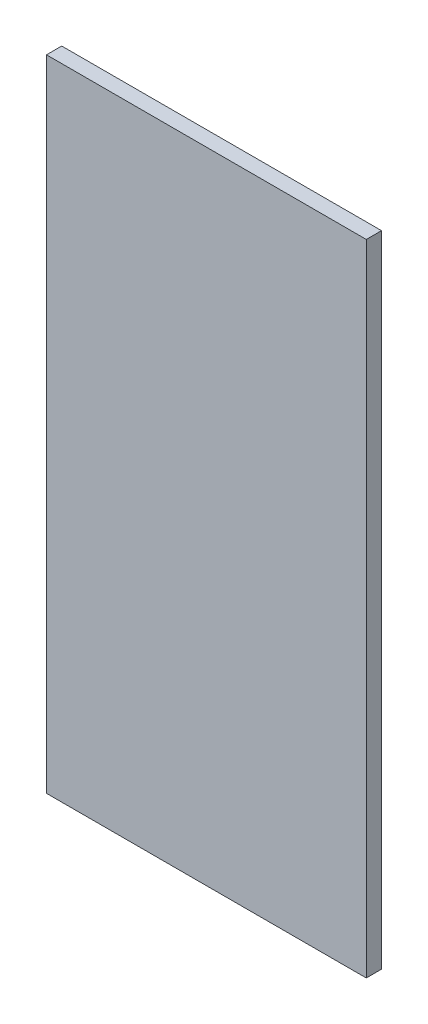
ISO-10303-21;
HEADER;
FILE_DESCRIPTION(('STEP AP214'),'2;1');
FILE_NAME('part.step','',(''),(''),'','','');
FILE_SCHEMA(('AUTOMOTIVE_DESIGN { 1 0 10303 214 1 1 1 1 }'));
ENDSEC;
DATA;
#1=APPLICATION_CONTEXT('core data for automotive mechanical design processes');
#2=APPLICATION_PROTOCOL_DEFINITION('international standard','automotive_design',2000,#1);
#3=PRODUCT_CONTEXT('',#1,'mechanical');
#4=PRODUCT('Part','Part','',(#3));
#5=PRODUCT_RELATED_PRODUCT_CATEGORY('part','',(#4));
#6=PRODUCT_DEFINITION_FORMATION('','',#4);
#7=PRODUCT_DEFINITION_CONTEXT('part definition',#1,'design');
#8=PRODUCT_DEFINITION('design','',#6,#7);
#9=PRODUCT_DEFINITION_SHAPE('','',#8);
#10=(LENGTH_UNIT() NAMED_UNIT(*) SI_UNIT(.MILLI.,.METRE.));
#11=(NAMED_UNIT(*) PLANE_ANGLE_UNIT() SI_UNIT($,.RADIAN.));
#12=(NAMED_UNIT(*) SI_UNIT($,.STERADIAN.) SOLID_ANGLE_UNIT());
#13=UNCERTAINTY_MEASURE_WITH_UNIT(LENGTH_MEASURE(1.E-05),#10,'distance_accuracy_value','');
#14=(GEOMETRIC_REPRESENTATION_CONTEXT(3) GLOBAL_UNCERTAINTY_ASSIGNED_CONTEXT((#13)) GLOBAL_UNIT_ASSIGNED_CONTEXT((#10,
#11,#12)) REPRESENTATION_CONTEXT('',''));
#15=CARTESIAN_POINT('',(0.,0.,0.));
#16=DIRECTION('',(0.,0.,1.));
#17=DIRECTION('',(1.,0.,0.));
#18=AXIS2_PLACEMENT_3D('',#15,#16,#17);
#19=CARTESIAN_POINT('',(-26.67,53.34,1.27));
#20=DIRECTION('',(1.,0.,0.));
#21=DIRECTION('',(0.,1.,0.));
#22=AXIS2_PLACEMENT_3D('',#19,#20,#21);
#23=PLANE('',#22);
#24=DIRECTION('',(0.,-1.,0.));
#25=VECTOR('',#24,1.);
#26=CARTESIAN_POINT('',(-26.67,53.34,-1.27));
#27=LINE('',#26,#25);
#28=CARTESIAN_POINT('',(-26.67,53.34,-1.27));
#29=VERTEX_POINT('',#28);
#30=CARTESIAN_POINT('',(-26.67,-53.34,-1.27));
#31=VERTEX_POINT('',#30);
#32=EDGE_CURVE('E96',#29,#31,#27,.T.);
#33=ORIENTED_EDGE('',*,*,#32,.T.);
#34=DIRECTION('',(0.,0.,-1.));
#35=VECTOR('',#34,1.);
#36=CARTESIAN_POINT('',(-26.67,-53.34,1.27));
#37=LINE('',#36,#35);
#38=CARTESIAN_POINT('',(-26.67,-53.34,1.27));
#39=VERTEX_POINT('',#38);
#40=EDGE_CURVE('E11',#39,#31,#37,.T.);
#41=ORIENTED_EDGE('',*,*,#40,.F.);
#42=DIRECTION('',(0.,-1.,0.));
#43=VECTOR('',#42,1.);
#44=CARTESIAN_POINT('',(-26.67,53.34,1.27));
#45=LINE('',#44,#43);
#46=CARTESIAN_POINT('',(-26.67,53.34,1.27));
#47=VERTEX_POINT('',#46);
#48=EDGE_CURVE('E84',#47,#39,#45,.T.);
#49=ORIENTED_EDGE('',*,*,#48,.F.);
#50=DIRECTION('',(0.,0.,-1.));
#51=VECTOR('',#50,1.);
#52=CARTESIAN_POINT('',(-26.67,53.34,1.27));
#53=LINE('',#52,#51);
#54=EDGE_CURVE('E92',#47,#29,#53,.T.);
#55=ORIENTED_EDGE('',*,*,#54,.T.);
#56=EDGE_LOOP('',(#33,#41,#49,#55));
#57=FACE_BOUND('',#56,.T.);
#58=ADVANCED_FACE('F33',(#57),#23,.F.);
#59=CARTESIAN_POINT('',(26.67,-53.34,1.27));
#60=DIRECTION('',(0.,1.,0.));
#61=DIRECTION('',(-1.,0.,0.));
#62=AXIS2_PLACEMENT_3D('',#59,#60,#61);
#63=PLANE('',#62);
#64=DIRECTION('',(1.,0.,0.));
#65=VECTOR('',#64,1.);
#66=CARTESIAN_POINT('',(26.67,-53.34,-1.27));
#67=LINE('',#66,#65);
#68=CARTESIAN_POINT('',(26.67,-53.34,-1.27));
#69=VERTEX_POINT('',#68);
#70=EDGE_CURVE('E88',#31,#69,#67,.T.);
#71=ORIENTED_EDGE('',*,*,#70,.T.);
#72=DIRECTION('',(0.,0.,-1.));
#73=VECTOR('',#72,1.);
#74=CARTESIAN_POINT('',(26.67,-53.34,1.27));
#75=LINE('',#74,#73);
#76=CARTESIAN_POINT('',(26.67,-53.34,1.27));
#77=VERTEX_POINT('',#76);
#78=EDGE_CURVE('E41',#77,#69,#75,.T.);
#79=ORIENTED_EDGE('',*,*,#78,.F.);
#80=DIRECTION('',(1.,0.,0.));
#81=VECTOR('',#80,1.);
#82=CARTESIAN_POINT('',(26.67,-53.34,1.27));
#83=LINE('',#82,#81);
#84=EDGE_CURVE('E79',#39,#77,#83,.T.);
#85=ORIENTED_EDGE('',*,*,#84,.F.);
#86=ORIENTED_EDGE('',*,*,#40,.T.);
#87=EDGE_LOOP('',(#71,#79,#85,#86));
#88=FACE_BOUND('',#87,.T.);
#89=ADVANCED_FACE('F87',(#88),#63,.F.);
#90=CARTESIAN_POINT('',(26.67,53.34,1.27));
#91=DIRECTION('',(-1.,0.,0.));
#92=DIRECTION('',(0.,-1.,0.));
#93=AXIS2_PLACEMENT_3D('',#90,#91,#92);
#94=PLANE('',#93);
#95=DIRECTION('',(0.,1.,0.));
#96=VECTOR('',#95,1.);
#97=CARTESIAN_POINT('',(26.67,53.34,-1.27));
#98=LINE('',#97,#96);
#99=CARTESIAN_POINT('',(26.67,53.34,-1.27));
#100=VERTEX_POINT('',#99);
#101=EDGE_CURVE('E66',#69,#100,#98,.T.);
#102=ORIENTED_EDGE('',*,*,#101,.T.);
#103=DIRECTION('',(0.,0.,-1.));
#104=VECTOR('',#103,1.);
#105=CARTESIAN_POINT('',(26.67,53.34,1.27));
#106=LINE('',#105,#104);
#107=CARTESIAN_POINT('',(26.67,53.34,1.27));
#108=VERTEX_POINT('',#107);
#109=EDGE_CURVE('E89',#108,#100,#106,.T.);
#110=ORIENTED_EDGE('',*,*,#109,.F.);
#111=DIRECTION('',(0.,1.,0.));
#112=VECTOR('',#111,1.);
#113=CARTESIAN_POINT('',(26.67,53.34,1.27));
#114=LINE('',#113,#112);
#115=EDGE_CURVE('E82',#77,#108,#114,.T.);
#116=ORIENTED_EDGE('',*,*,#115,.F.);
#117=ORIENTED_EDGE('',*,*,#78,.T.);
#118=EDGE_LOOP('',(#102,#110,#116,#117));
#119=FACE_BOUND('',#118,.T.);
#120=ADVANCED_FACE('F90',(#119),#94,.F.);
#121=CARTESIAN_POINT('',(26.67,53.34,1.27));
#122=DIRECTION('',(0.,-1.,0.));
#123=DIRECTION('',(0.,0.,-1.));
#124=AXIS2_PLACEMENT_3D('',#121,#122,#123);
#125=PLANE('',#124);
#126=DIRECTION('',(-1.,0.,0.));
#127=VECTOR('',#126,1.);
#128=CARTESIAN_POINT('',(26.67,53.34,-1.27));
#129=LINE('',#128,#127);
#130=EDGE_CURVE('E72',#100,#29,#129,.T.);
#131=ORIENTED_EDGE('',*,*,#130,.T.);
#132=ORIENTED_EDGE('',*,*,#54,.F.);
#133=DIRECTION('',(-1.,0.,0.));
#134=VECTOR('',#133,1.);
#135=CARTESIAN_POINT('',(26.67,53.34,1.27));
#136=LINE('',#135,#134);
#137=EDGE_CURVE('E49',#108,#47,#136,.T.);
#138=ORIENTED_EDGE('',*,*,#137,.F.);
#139=ORIENTED_EDGE('',*,*,#109,.T.);
#140=EDGE_LOOP('',(#131,#132,#138,#139));
#141=FACE_BOUND('',#140,.T.);
#142=ADVANCED_FACE('F103',(#141),#125,.F.);
#143=CARTESIAN_POINT('',(-26.67,-53.34,1.27));
#144=DIRECTION('',(0.,0.,-1.));
#145=DIRECTION('',(-1.,0.,0.));
#146=AXIS2_PLACEMENT_3D('',#143,#144,#145);
#147=PLANE('',#146);
#148=ORIENTED_EDGE('',*,*,#48,.T.);
#149=ORIENTED_EDGE('',*,*,#84,.T.);
#150=ORIENTED_EDGE('',*,*,#115,.T.);
#151=ORIENTED_EDGE('',*,*,#137,.T.);
#152=EDGE_LOOP('',(#148,#149,#150,#151));
#153=FACE_BOUND('',#152,.T.);
#154=ADVANCED_FACE('F80',(#153),#147,.F.);
#155=CARTESIAN_POINT('',(-26.67,-53.34,-1.27));
#156=DIRECTION('',(0.,0.,-1.));
#157=DIRECTION('',(-1.,0.,0.));
#158=AXIS2_PLACEMENT_3D('',#155,#156,#157);
#159=PLANE('',#158);
#160=ORIENTED_EDGE('',*,*,#32,.F.);
#161=ORIENTED_EDGE('',*,*,#130,.F.);
#162=ORIENTED_EDGE('',*,*,#101,.F.);
#163=ORIENTED_EDGE('',*,*,#70,.F.);
#164=EDGE_LOOP('',(#160,#161,#162,#163));
#165=FACE_BOUND('',#164,.T.);
#166=ADVANCED_FACE('F106',(#165),#159,.T.);
#167=CLOSED_SHELL('',(#58,#89,#120,#142,#154,#166));
#168=MANIFOLD_SOLID_BREP('B2',#167);
#169=ADVANCED_BREP_SHAPE_REPRESENTATION('',(#18,#168),#14);
#170=SHAPE_DEFINITION_REPRESENTATION(#9,#169);
ENDSEC;
END-ISO-10303-21;
